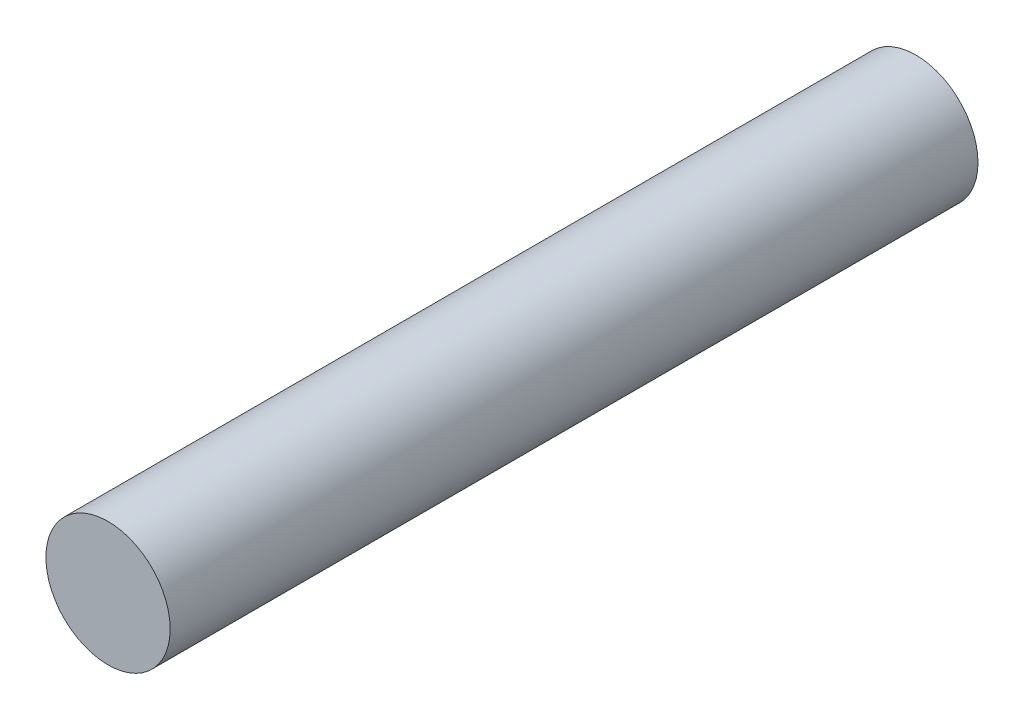
ISO-10303-21;
HEADER;
FILE_DESCRIPTION(('STEP AP214'),'2;1');
FILE_NAME('part.step','',(''),(''),'','','');
FILE_SCHEMA(('AUTOMOTIVE_DESIGN { 1 0 10303 214 1 1 1 1 }'));
ENDSEC;
DATA;
#1=APPLICATION_CONTEXT('core data for automotive mechanical design processes');
#2=APPLICATION_PROTOCOL_DEFINITION('international standard','automotive_design',2000,#1);
#3=PRODUCT_CONTEXT('',#1,'mechanical');
#4=PRODUCT('Part','Part','',(#3));
#5=PRODUCT_RELATED_PRODUCT_CATEGORY('part','',(#4));
#6=PRODUCT_DEFINITION_FORMATION('','',#4);
#7=PRODUCT_DEFINITION_CONTEXT('part definition',#1,'design');
#8=PRODUCT_DEFINITION('design','',#6,#7);
#9=PRODUCT_DEFINITION_SHAPE('','',#8);
#10=(LENGTH_UNIT() NAMED_UNIT(*) SI_UNIT(.MILLI.,.METRE.));
#11=(NAMED_UNIT(*) PLANE_ANGLE_UNIT() SI_UNIT($,.RADIAN.));
#12=(NAMED_UNIT(*) SI_UNIT($,.STERADIAN.) SOLID_ANGLE_UNIT());
#13=UNCERTAINTY_MEASURE_WITH_UNIT(LENGTH_MEASURE(1.E-05),#10,'distance_accuracy_value','');
#14=(GEOMETRIC_REPRESENTATION_CONTEXT(3) GLOBAL_UNCERTAINTY_ASSIGNED_CONTEXT((#13)) GLOBAL_UNIT_ASSIGNED_CONTEXT((#10,
#11,#12)) REPRESENTATION_CONTEXT('',''));
#15=CARTESIAN_POINT('',(0.,0.,0.));
#16=DIRECTION('',(0.,0.,1.));
#17=DIRECTION('',(1.,0.,0.));
#18=AXIS2_PLACEMENT_3D('',#15,#16,#17);
#19=CARTESIAN_POINT('',(0.,0.,26.));
#20=DIRECTION('',(0.,0.,-1.));
#21=DIRECTION('',(-1.,0.,0.));
#22=AXIS2_PLACEMENT_3D('',#19,#20,#21);
#23=CYLINDRICAL_SURFACE('',#22,4.);
#24=CARTESIAN_POINT('',(0.,0.,26.));
#25=DIRECTION('',(0.,0.,1.));
#26=DIRECTION('',(1.,0.,0.));
#27=AXIS2_PLACEMENT_3D('',#24,#25,#26);
#28=CIRCLE('',#27,4.);
#29=CARTESIAN_POINT('',(4.,0.,26.));
#30=VERTEX_POINT('',#29);
#31=EDGE_CURVE('E10',#30,#30,#28,.T.);
#32=ORIENTED_EDGE('',*,*,#31,.F.);
#33=EDGE_LOOP('',(#32));
#34=FACE_BOUND('',#33,.T.);
#35=CARTESIAN_POINT('',(0.,0.,-26.));
#36=DIRECTION('',(0.,0.,1.));
#37=DIRECTION('',(1.,0.,0.));
#38=AXIS2_PLACEMENT_3D('',#35,#36,#37);
#39=CIRCLE('',#38,4.);
#40=CARTESIAN_POINT('',(4.,0.,-26.));
#41=VERTEX_POINT('',#40);
#42=EDGE_CURVE('E45',#41,#41,#39,.T.);
#43=ORIENTED_EDGE('',*,*,#42,.T.);
#44=EDGE_LOOP('',(#43));
#45=FACE_BOUND('',#44,.T.);
#46=ADVANCED_FACE('F39',(#34,#45),#23,.T.);
#47=CARTESIAN_POINT('',(0.,0.,26.));
#48=DIRECTION('',(0.,0.,1.));
#49=DIRECTION('',(1.,0.,0.));
#50=AXIS2_PLACEMENT_3D('',#47,#48,#49);
#51=PLANE('',#50);
#52=ORIENTED_EDGE('',*,*,#31,.T.);
#53=EDGE_LOOP('',(#52));
#54=FACE_BOUND('',#53,.T.);
#55=ADVANCED_FACE('F54',(#54),#51,.T.);
#56=CARTESIAN_POINT('',(0.,0.,-26.));
#57=DIRECTION('',(0.,0.,-1.));
#58=DIRECTION('',(1.,0.,0.));
#59=AXIS2_PLACEMENT_3D('',#56,#57,#58);
#60=PLANE('',#59);
#61=ORIENTED_EDGE('',*,*,#42,.F.);
#62=EDGE_LOOP('',(#61));
#63=FACE_BOUND('',#62,.T.);
#64=ADVANCED_FACE('F52',(#63),#60,.T.);
#65=CLOSED_SHELL('',(#46,#55,#64));
#66=MANIFOLD_SOLID_BREP('B2',#65);
#67=ADVANCED_BREP_SHAPE_REPRESENTATION('',(#18,#66),#14);
#68=SHAPE_DEFINITION_REPRESENTATION(#9,#67);
ENDSEC;
END-ISO-10303-21;
